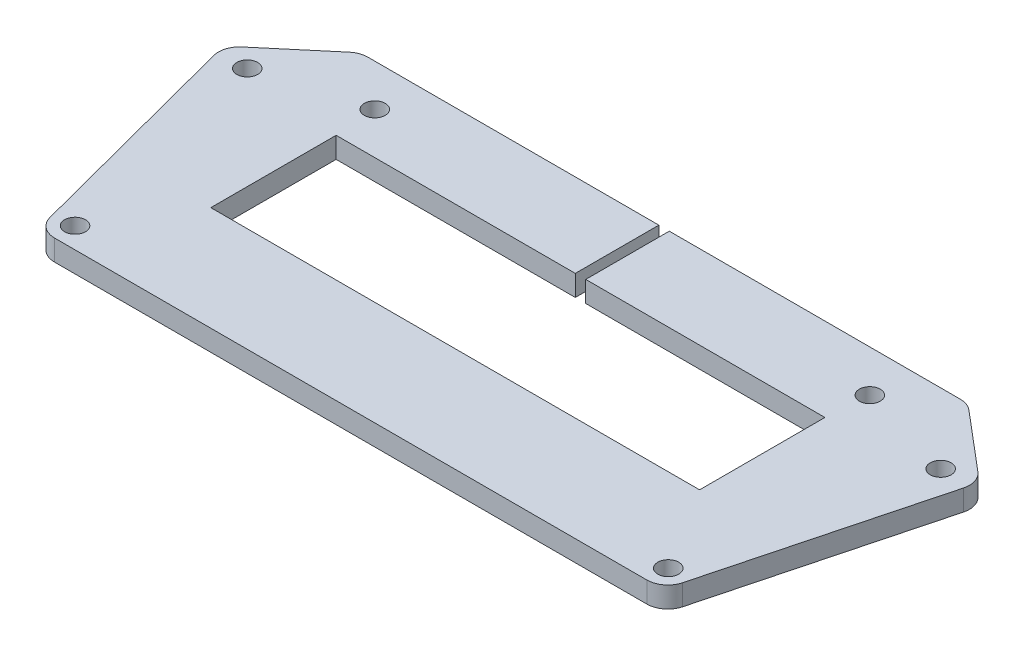
ISO-10303-21;
HEADER;
FILE_DESCRIPTION(('STEP AP214'),'2;1');
FILE_NAME('part.step','',(''),(''),'','','');
FILE_SCHEMA(('AUTOMOTIVE_DESIGN { 1 0 10303 214 1 1 1 1 }'));
ENDSEC;
DATA;
#1=APPLICATION_CONTEXT('core data for automotive mechanical design processes');
#2=APPLICATION_PROTOCOL_DEFINITION('international standard','automotive_design',2000,#1);
#3=PRODUCT_CONTEXT('',#1,'mechanical');
#4=PRODUCT('Part','Part','',(#3));
#5=PRODUCT_RELATED_PRODUCT_CATEGORY('part','',(#4));
#6=PRODUCT_DEFINITION_FORMATION('','',#4);
#7=PRODUCT_DEFINITION_CONTEXT('part definition',#1,'design');
#8=PRODUCT_DEFINITION('design','',#6,#7);
#9=PRODUCT_DEFINITION_SHAPE('','',#8);
#10=(LENGTH_UNIT() NAMED_UNIT(*) SI_UNIT(.MILLI.,.METRE.));
#11=(NAMED_UNIT(*) PLANE_ANGLE_UNIT() SI_UNIT($,.RADIAN.));
#12=(NAMED_UNIT(*) SI_UNIT($,.STERADIAN.) SOLID_ANGLE_UNIT());
#13=UNCERTAINTY_MEASURE_WITH_UNIT(LENGTH_MEASURE(1.E-05),#10,'distance_accuracy_value','');
#14=(GEOMETRIC_REPRESENTATION_CONTEXT(3) GLOBAL_UNCERTAINTY_ASSIGNED_CONTEXT((#13)) GLOBAL_UNIT_ASSIGNED_CONTEXT((#10,
#11,#12)) REPRESENTATION_CONTEXT('',''));
#15=CARTESIAN_POINT('',(0.,0.,0.));
#16=DIRECTION('',(0.,0.,1.));
#17=DIRECTION('',(1.,0.,0.));
#18=AXIS2_PLACEMENT_3D('',#15,#16,#17);
#19=CARTESIAN_POINT('',(-11.7,-1.,-3.));
#20=DIRECTION('',(1.,0.,0.));
#21=DIRECTION('',(0.,0.,-1.));
#22=AXIS2_PLACEMENT_3D('',#19,#20,#21);
#23=PLANE('',#22);
#24=DIRECTION('',(0.,0.,-1.));
#25=VECTOR('',#24,1.);
#26=CARTESIAN_POINT('',(-11.7,0.,-3.));
#27=LINE('',#26,#25);
#28=CARTESIAN_POINT('',(-11.7,0.,3.));
#29=VERTEX_POINT('',#28);
#30=CARTESIAN_POINT('',(-11.7,0.,-3.));
#31=VERTEX_POINT('',#30);
#32=EDGE_CURVE('E210',#29,#31,#27,.T.);
#33=ORIENTED_EDGE('',*,*,#32,.F.);
#34=DIRECTION('',(0.,1.,0.));
#35=VECTOR('',#34,1.);
#36=CARTESIAN_POINT('',(-11.7,-1.,3.));
#37=LINE('',#36,#35);
#38=CARTESIAN_POINT('',(-11.7,-1.,3.));
#39=VERTEX_POINT('',#38);
#40=EDGE_CURVE('E12',#39,#29,#37,.T.);
#41=ORIENTED_EDGE('',*,*,#40,.F.);
#42=DIRECTION('',(0.,0.,-1.));
#43=VECTOR('',#42,1.);
#44=CARTESIAN_POINT('',(-11.7,-1.,-3.));
#45=LINE('',#44,#43);
#46=CARTESIAN_POINT('',(-11.7,-1.,-3.));
#47=VERTEX_POINT('',#46);
#48=EDGE_CURVE('E267',#39,#47,#45,.T.);
#49=ORIENTED_EDGE('',*,*,#48,.T.);
#50=DIRECTION('',(0.,1.,0.));
#51=VECTOR('',#50,1.);
#52=CARTESIAN_POINT('',(-11.7,-1.,-3.));
#53=LINE('',#52,#51);
#54=EDGE_CURVE('E44',#47,#31,#53,.T.);
#55=ORIENTED_EDGE('',*,*,#54,.T.);
#56=EDGE_LOOP('',(#33,#41,#49,#55));
#57=FACE_BOUND('',#56,.T.);
#58=ADVANCED_FACE('F41',(#57),#23,.T.);
#59=CARTESIAN_POINT('',(-11.7,-1.,3.));
#60=DIRECTION('',(0.,0.,-1.));
#61=DIRECTION('',(-1.,0.,0.));
#62=AXIS2_PLACEMENT_3D('',#59,#60,#61);
#63=PLANE('',#62);
#64=DIRECTION('',(-1.,0.,0.));
#65=VECTOR('',#64,1.);
#66=CARTESIAN_POINT('',(-11.7,0.,3.));
#67=LINE('',#66,#65);
#68=CARTESIAN_POINT('',(11.7,0.,3.));
#69=VERTEX_POINT('',#68);
#70=EDGE_CURVE('E265',#69,#29,#67,.T.);
#71=ORIENTED_EDGE('',*,*,#70,.F.);
#72=DIRECTION('',(0.,1.,0.));
#73=VECTOR('',#72,1.);
#74=CARTESIAN_POINT('',(11.7,-1.,3.));
#75=LINE('',#74,#73);
#76=CARTESIAN_POINT('',(11.7,-1.,3.));
#77=VERTEX_POINT('',#76);
#78=EDGE_CURVE('E50',#77,#69,#75,.T.);
#79=ORIENTED_EDGE('',*,*,#78,.F.);
#80=DIRECTION('',(-1.,0.,0.));
#81=VECTOR('',#80,1.);
#82=CARTESIAN_POINT('',(-11.7,-1.,3.));
#83=LINE('',#82,#81);
#84=EDGE_CURVE('E200',#77,#39,#83,.T.);
#85=ORIENTED_EDGE('',*,*,#84,.T.);
#86=ORIENTED_EDGE('',*,*,#40,.T.);
#87=EDGE_LOOP('',(#71,#79,#85,#86));
#88=FACE_BOUND('',#87,.T.);
#89=ADVANCED_FACE('F303',(#88),#63,.T.);
#90=CARTESIAN_POINT('',(11.7,-1.,-3.));
#91=DIRECTION('',(-1.,0.,0.));
#92=DIRECTION('',(0.,0.,1.));
#93=AXIS2_PLACEMENT_3D('',#90,#91,#92);
#94=PLANE('',#93);
#95=DIRECTION('',(0.,0.,1.));
#96=VECTOR('',#95,1.);
#97=CARTESIAN_POINT('',(11.7,0.,-3.));
#98=LINE('',#97,#96);
#99=CARTESIAN_POINT('',(11.7,0.,-3.));
#100=VERTEX_POINT('',#99);
#101=EDGE_CURVE('E187',#100,#69,#98,.T.);
#102=ORIENTED_EDGE('',*,*,#101,.F.);
#103=DIRECTION('',(0.,1.,0.));
#104=VECTOR('',#103,1.);
#105=CARTESIAN_POINT('',(11.7,-1.,-3.));
#106=LINE('',#105,#104);
#107=CARTESIAN_POINT('',(11.7,-1.,-3.));
#108=VERTEX_POINT('',#107);
#109=EDGE_CURVE('E182',#108,#100,#106,.T.);
#110=ORIENTED_EDGE('',*,*,#109,.F.);
#111=DIRECTION('',(0.,0.,1.));
#112=VECTOR('',#111,1.);
#113=CARTESIAN_POINT('',(11.7,-1.,-3.));
#114=LINE('',#113,#112);
#115=EDGE_CURVE('E185',#108,#77,#114,.T.);
#116=ORIENTED_EDGE('',*,*,#115,.T.);
#117=ORIENTED_EDGE('',*,*,#78,.T.);
#118=EDGE_LOOP('',(#102,#110,#116,#117));
#119=FACE_BOUND('',#118,.T.);
#120=ADVANCED_FACE('F184',(#119),#94,.T.);
#121=CARTESIAN_POINT('',(0.25,-1.,-3.));
#122=DIRECTION('',(0.,0.,1.));
#123=DIRECTION('',(1.,0.,0.));
#124=AXIS2_PLACEMENT_3D('',#121,#122,#123);
#125=PLANE('',#124);
#126=DIRECTION('',(1.,0.,0.));
#127=VECTOR('',#126,1.);
#128=CARTESIAN_POINT('',(0.25,0.,-3.));
#129=LINE('',#128,#127);
#130=CARTESIAN_POINT('',(0.25,0.,-3.));
#131=VERTEX_POINT('',#130);
#132=EDGE_CURVE('E262',#131,#100,#129,.T.);
#133=ORIENTED_EDGE('',*,*,#132,.F.);
#134=DIRECTION('',(0.,1.,0.));
#135=VECTOR('',#134,1.);
#136=CARTESIAN_POINT('',(0.25,-1.,-3.));
#137=LINE('',#136,#135);
#138=CARTESIAN_POINT('',(0.25,-1.,-3.));
#139=VERTEX_POINT('',#138);
#140=EDGE_CURVE('E192',#139,#131,#137,.T.);
#141=ORIENTED_EDGE('',*,*,#140,.F.);
#142=DIRECTION('',(1.,0.,0.));
#143=VECTOR('',#142,1.);
#144=CARTESIAN_POINT('',(0.25,-1.,-3.));
#145=LINE('',#144,#143);
#146=EDGE_CURVE('E198',#139,#108,#145,.T.);
#147=ORIENTED_EDGE('',*,*,#146,.T.);
#148=ORIENTED_EDGE('',*,*,#109,.T.);
#149=EDGE_LOOP('',(#133,#141,#147,#148));
#150=FACE_BOUND('',#149,.T.);
#151=ADVANCED_FACE('F202',(#150),#125,.T.);
#152=CARTESIAN_POINT('',(0.249999999999999,-1.,-7.));
#153=DIRECTION('',(-1.,0.,0.));
#154=DIRECTION('',(0.,0.,1.));
#155=AXIS2_PLACEMENT_3D('',#152,#153,#154);
#156=PLANE('',#155);
#157=DIRECTION('',(0.,0.,1.));
#158=VECTOR('',#157,1.);
#159=CARTESIAN_POINT('',(0.249999999999999,0.,-7.));
#160=LINE('',#159,#158);
#161=CARTESIAN_POINT('',(0.249999999999999,0.,-7.));
#162=VERTEX_POINT('',#161);
#163=EDGE_CURVE('E259',#162,#131,#160,.T.);
#164=ORIENTED_EDGE('',*,*,#163,.F.);
#165=DIRECTION('',(0.,1.,0.));
#166=VECTOR('',#165,1.);
#167=CARTESIAN_POINT('',(0.249999999999999,-1.,-7.));
#168=LINE('',#167,#166);
#169=CARTESIAN_POINT('',(0.249999999999999,-1.,-7.));
#170=VERTEX_POINT('',#169);
#171=EDGE_CURVE('E271',#170,#162,#168,.T.);
#172=ORIENTED_EDGE('',*,*,#171,.F.);
#173=DIRECTION('',(0.,0.,1.));
#174=VECTOR('',#173,1.);
#175=CARTESIAN_POINT('',(0.249999999999999,-1.,-7.));
#176=LINE('',#175,#174);
#177=EDGE_CURVE('E203',#170,#139,#176,.T.);
#178=ORIENTED_EDGE('',*,*,#177,.T.);
#179=ORIENTED_EDGE('',*,*,#140,.T.);
#180=EDGE_LOOP('',(#164,#172,#178,#179));
#181=FACE_BOUND('',#180,.T.);
#182=ADVANCED_FACE('F316',(#181),#156,.T.);
#183=CARTESIAN_POINT('',(0.249999999999999,-1.,-7.));
#184=DIRECTION('',(0.,0.,-1.));
#185=DIRECTION('',(-1.,0.,0.));
#186=AXIS2_PLACEMENT_3D('',#183,#184,#185);
#187=PLANE('',#186);
#188=DIRECTION('',(-1.,0.,0.));
#189=VECTOR('',#188,1.);
#190=CARTESIAN_POINT('',(0.249999999999999,0.,-7.));
#191=LINE('',#190,#189);
#192=CARTESIAN_POINT('',(14.1840503450521,0.,-7.));
#193=VERTEX_POINT('',#192);
#194=EDGE_CURVE('E256',#193,#162,#191,.T.);
#195=ORIENTED_EDGE('',*,*,#194,.F.);
#196=DIRECTION('',(0.,1.,0.));
#197=VECTOR('',#196,1.);
#198=CARTESIAN_POINT('',(14.1840503450521,-1.,-7.));
#199=LINE('',#198,#197);
#200=CARTESIAN_POINT('',(14.1840503450521,-1.,-7.));
#201=VERTEX_POINT('',#200);
#202=EDGE_CURVE('E273',#201,#193,#199,.T.);
#203=ORIENTED_EDGE('',*,*,#202,.F.);
#204=DIRECTION('',(-1.,0.,0.));
#205=VECTOR('',#204,1.);
#206=CARTESIAN_POINT('',(0.249999999999999,-1.,-7.));
#207=LINE('',#206,#205);
#208=EDGE_CURVE('E205',#201,#170,#207,.T.);
#209=ORIENTED_EDGE('',*,*,#208,.T.);
#210=ORIENTED_EDGE('',*,*,#171,.T.);
#211=EDGE_LOOP('',(#195,#203,#209,#210));
#212=FACE_BOUND('',#211,.T.);
#213=ADVANCED_FACE('F319',(#212),#187,.T.);
#214=CARTESIAN_POINT('',(14.1840503450521,-1.,-6.));
#215=DIRECTION('',(0.,1.,0.));
#216=DIRECTION('',(0.,0.,1.));
#217=AXIS2_PLACEMENT_3D('',#214,#215,#216);
#218=CYLINDRICAL_SURFACE('',#217,0.999999999999998);
#219=CARTESIAN_POINT('',(14.1840503450521,0.,-6.));
#220=DIRECTION('',(0.,1.,0.));
#221=DIRECTION('',(0.,0.,-1.));
#222=AXIS2_PLACEMENT_3D('',#219,#220,#221);
#223=CIRCLE('',#222,0.999999999999998);
#224=CARTESIAN_POINT('',(14.8295102174988,0.,-6.76379418239535));
#225=VERTEX_POINT('',#224);
#226=EDGE_CURVE('E253',#225,#193,#223,.T.);
#227=ORIENTED_EDGE('',*,*,#226,.F.);
#228=DIRECTION('',(0.,1.,0.));
#229=VECTOR('',#228,1.);
#230=CARTESIAN_POINT('',(14.8295102174988,-1.,-6.76379418239535));
#231=LINE('',#230,#229);
#232=CARTESIAN_POINT('',(14.8295102174988,-1.,-6.76379418239535));
#233=VERTEX_POINT('',#232);
#234=EDGE_CURVE('E275',#233,#225,#231,.T.);
#235=ORIENTED_EDGE('',*,*,#234,.F.);
#236=CARTESIAN_POINT('',(14.1840503450521,-1.,-6.));
#237=DIRECTION('',(0.,1.,0.));
#238=DIRECTION('',(0.,0.,-1.));
#239=AXIS2_PLACEMENT_3D('',#236,#237,#238);
#240=CIRCLE('',#239,0.999999999999998);
#241=EDGE_CURVE('E489',#233,#201,#240,.T.);
#242=ORIENTED_EDGE('',*,*,#241,.T.);
#243=ORIENTED_EDGE('',*,*,#202,.T.);
#244=EDGE_LOOP('',(#227,#235,#242,#243));
#245=FACE_BOUND('',#244,.T.);
#246=ADVANCED_FACE('F323',(#245),#218,.T.);
#247=CARTESIAN_POINT('',(17.6180059015459,-1.,-4.40731895644008));
#248=DIRECTION('',(0.645459872446779,0.,-0.763794182395355));
#249=DIRECTION('',(-0.763794182395355,0.,-0.645459872446779));
#250=AXIS2_PLACEMENT_3D('',#247,#248,#249);
#251=PLANE('',#250);
#252=DIRECTION('',(-0.763794182395355,0.,-0.645459872446779));
#253=VECTOR('',#252,1.);
#254=CARTESIAN_POINT('',(17.6180059015459,0.,-4.40731895644008));
#255=LINE('',#254,#253);
#256=CARTESIAN_POINT('',(17.6180059015459,0.,-4.40731895644008));
#257=VERTEX_POINT('',#256);
#258=EDGE_CURVE('E250',#257,#225,#255,.T.);
#259=ORIENTED_EDGE('',*,*,#258,.F.);
#260=DIRECTION('',(0.,1.,0.));
#261=VECTOR('',#260,1.);
#262=CARTESIAN_POINT('',(17.6180059015459,-1.,-4.40731895644008));
#263=LINE('',#262,#261);
#264=CARTESIAN_POINT('',(17.6180059015459,-1.,-4.40731895644008));
#265=VERTEX_POINT('',#264);
#266=EDGE_CURVE('E277',#265,#257,#263,.T.);
#267=ORIENTED_EDGE('',*,*,#266,.F.);
#268=DIRECTION('',(-0.763794182395355,0.,-0.645459872446779));
#269=VECTOR('',#268,1.);
#270=CARTESIAN_POINT('',(17.6180059015459,-1.,-4.40731895644008));
#271=LINE('',#270,#269);
#272=EDGE_CURVE('E486',#265,#233,#271,.T.);
#273=ORIENTED_EDGE('',*,*,#272,.T.);
#274=ORIENTED_EDGE('',*,*,#234,.T.);
#275=EDGE_LOOP('',(#259,#267,#273,#274));
#276=FACE_BOUND('',#275,.T.);
#277=ADVANCED_FACE('F327',(#276),#251,.T.);
#278=CARTESIAN_POINT('',(16.9725460290991,-1.,-3.64352477404472));
#279=DIRECTION('',(0.,1.,0.));
#280=DIRECTION('',(0.,0.,1.));
#281=AXIS2_PLACEMENT_3D('',#278,#279,#280);
#282=CYLINDRICAL_SURFACE('',#281,1.);
#283=CARTESIAN_POINT('',(16.9725460290991,0.,-3.64352477404472));
#284=DIRECTION('',(0.,1.,0.));
#285=DIRECTION('',(0.,0.,-1.));
#286=AXIS2_PLACEMENT_3D('',#283,#284,#285);
#287=CIRCLE('',#286,1.);
#288=CARTESIAN_POINT('',(17.9397769944786,0.,-3.38962664563262));
#289=VERTEX_POINT('',#288);
#290=EDGE_CURVE('E247',#289,#257,#287,.T.);
#291=ORIENTED_EDGE('',*,*,#290,.F.);
#292=DIRECTION('',(0.,1.,0.));
#293=VECTOR('',#292,1.);
#294=CARTESIAN_POINT('',(17.9397769944786,-1.,-3.38962664563262));
#295=LINE('',#294,#293);
#296=CARTESIAN_POINT('',(17.9397769944786,-1.,-3.38962664563262));
#297=VERTEX_POINT('',#296);
#298=EDGE_CURVE('E279',#297,#289,#295,.T.);
#299=ORIENTED_EDGE('',*,*,#298,.F.);
#300=CARTESIAN_POINT('',(16.9725460290991,-1.,-3.64352477404472));
#301=DIRECTION('',(0.,1.,0.));
#302=DIRECTION('',(0.,0.,-1.));
#303=AXIS2_PLACEMENT_3D('',#300,#301,#302);
#304=CIRCLE('',#303,1.);
#305=EDGE_CURVE('E483',#297,#265,#304,.T.);
#306=ORIENTED_EDGE('',*,*,#305,.T.);
#307=ORIENTED_EDGE('',*,*,#266,.T.);
#308=EDGE_LOOP('',(#291,#299,#306,#307));
#309=FACE_BOUND('',#308,.T.);
#310=ADVANCED_FACE('F331',(#309),#282,.T.);
#311=CARTESIAN_POINT('',(15.1458517412918,-1.,7.2538981284121));
#312=DIRECTION('',(0.967230965379434,0.,0.253898128412102));
#313=DIRECTION('',(0.253898128412102,0.,-0.967230965379434));
#314=AXIS2_PLACEMENT_3D('',#311,#312,#313);
#315=PLANE('',#314);
#316=DIRECTION('',(0.253898128412102,0.,-0.967230965379434));
#317=VECTOR('',#316,1.);
#318=CARTESIAN_POINT('',(15.1458517412918,0.,7.2538981284121));
#319=LINE('',#318,#317);
#320=CARTESIAN_POINT('',(15.1458517412918,0.,7.2538981284121));
#321=VERTEX_POINT('',#320);
#322=EDGE_CURVE('E244',#321,#289,#319,.T.);
#323=ORIENTED_EDGE('',*,*,#322,.F.);
#324=DIRECTION('',(0.,1.,0.));
#325=VECTOR('',#324,1.);
#326=CARTESIAN_POINT('',(15.1458517412918,-1.,7.2538981284121));
#327=LINE('',#326,#325);
#328=CARTESIAN_POINT('',(15.1458517412918,-1.,7.2538981284121));
#329=VERTEX_POINT('',#328);
#330=EDGE_CURVE('E281',#329,#321,#327,.T.);
#331=ORIENTED_EDGE('',*,*,#330,.F.);
#332=DIRECTION('',(0.253898128412102,0.,-0.967230965379434));
#333=VECTOR('',#332,1.);
#334=CARTESIAN_POINT('',(15.1458517412918,-1.,7.2538981284121));
#335=LINE('',#334,#333);
#336=EDGE_CURVE('E480',#329,#297,#335,.T.);
#337=ORIENTED_EDGE('',*,*,#336,.T.);
#338=ORIENTED_EDGE('',*,*,#298,.T.);
#339=EDGE_LOOP('',(#323,#331,#337,#338));
#340=FACE_BOUND('',#339,.T.);
#341=ADVANCED_FACE('F335',(#340),#315,.T.);
#342=CARTESIAN_POINT('',(14.1786207759124,-1.,7.));
#343=DIRECTION('',(0.,1.,0.));
#344=DIRECTION('',(0.,0.,1.));
#345=AXIS2_PLACEMENT_3D('',#342,#343,#344);
#346=CYLINDRICAL_SURFACE('',#345,1.);
#347=CARTESIAN_POINT('',(14.1786207759124,0.,7.));
#348=DIRECTION('',(0.,1.,0.));
#349=DIRECTION('',(0.,0.,1.));
#350=AXIS2_PLACEMENT_3D('',#347,#348,#349);
#351=CIRCLE('',#350,1.);
#352=CARTESIAN_POINT('',(14.1786207759124,0.,8.));
#353=VERTEX_POINT('',#352);
#354=EDGE_CURVE('E241',#353,#321,#351,.T.);
#355=ORIENTED_EDGE('',*,*,#354,.F.);
#356=DIRECTION('',(0.,1.,0.));
#357=VECTOR('',#356,1.);
#358=CARTESIAN_POINT('',(14.1786207759124,-1.,8.));
#359=LINE('',#358,#357);
#360=CARTESIAN_POINT('',(14.1786207759124,-1.,8.));
#361=VERTEX_POINT('',#360);
#362=EDGE_CURVE('E283',#361,#353,#359,.T.);
#363=ORIENTED_EDGE('',*,*,#362,.F.);
#364=CARTESIAN_POINT('',(14.1786207759124,-1.,7.));
#365=DIRECTION('',(0.,1.,0.));
#366=DIRECTION('',(0.,0.,1.));
#367=AXIS2_PLACEMENT_3D('',#364,#365,#366);
#368=CIRCLE('',#367,1.);
#369=EDGE_CURVE('E477',#361,#329,#368,.T.);
#370=ORIENTED_EDGE('',*,*,#369,.T.);
#371=ORIENTED_EDGE('',*,*,#330,.T.);
#372=EDGE_LOOP('',(#355,#363,#370,#371));
#373=FACE_BOUND('',#372,.T.);
#374=ADVANCED_FACE('F339',(#373),#346,.T.);
#375=CARTESIAN_POINT('',(-14.1786207759124,-1.,8.));
#376=DIRECTION('',(0.,0.,1.));
#377=DIRECTION('',(1.,0.,0.));
#378=AXIS2_PLACEMENT_3D('',#375,#376,#377);
#379=PLANE('',#378);
#380=DIRECTION('',(1.,0.,0.));
#381=VECTOR('',#380,1.);
#382=CARTESIAN_POINT('',(-14.1786207759124,0.,8.));
#383=LINE('',#382,#381);
#384=CARTESIAN_POINT('',(-14.1786207759124,0.,8.));
#385=VERTEX_POINT('',#384);
#386=EDGE_CURVE('E238',#385,#353,#383,.T.);
#387=ORIENTED_EDGE('',*,*,#386,.F.);
#388=DIRECTION('',(0.,1.,0.));
#389=VECTOR('',#388,1.);
#390=CARTESIAN_POINT('',(-14.1786207759124,-1.,8.));
#391=LINE('',#390,#389);
#392=CARTESIAN_POINT('',(-14.1786207759124,-1.,8.));
#393=VERTEX_POINT('',#392);
#394=EDGE_CURVE('E285',#393,#385,#391,.T.);
#395=ORIENTED_EDGE('',*,*,#394,.F.);
#396=DIRECTION('',(1.,0.,0.));
#397=VECTOR('',#396,1.);
#398=CARTESIAN_POINT('',(-14.1786207759124,-1.,8.));
#399=LINE('',#398,#397);
#400=EDGE_CURVE('E474',#393,#361,#399,.T.);
#401=ORIENTED_EDGE('',*,*,#400,.T.);
#402=ORIENTED_EDGE('',*,*,#362,.T.);
#403=EDGE_LOOP('',(#387,#395,#401,#402));
#404=FACE_BOUND('',#403,.T.);
#405=ADVANCED_FACE('F343',(#404),#379,.T.);
#406=CARTESIAN_POINT('',(-14.1786207759124,-1.,7.));
#407=DIRECTION('',(0.,1.,0.));
#408=DIRECTION('',(0.,0.,1.));
#409=AXIS2_PLACEMENT_3D('',#406,#407,#408);
#410=CYLINDRICAL_SURFACE('',#409,1.);
#411=CARTESIAN_POINT('',(-14.1786207759124,0.,7.));
#412=DIRECTION('',(0.,1.,0.));
#413=DIRECTION('',(0.,0.,-1.));
#414=AXIS2_PLACEMENT_3D('',#411,#412,#413);
#415=CIRCLE('',#414,1.);
#416=CARTESIAN_POINT('',(-15.1458517412918,0.,7.2538981284121));
#417=VERTEX_POINT('',#416);
#418=EDGE_CURVE('E235',#417,#385,#415,.T.);
#419=ORIENTED_EDGE('',*,*,#418,.F.);
#420=DIRECTION('',(0.,1.,0.));
#421=VECTOR('',#420,1.);
#422=CARTESIAN_POINT('',(-15.1458517412918,-1.,7.2538981284121));
#423=LINE('',#422,#421);
#424=CARTESIAN_POINT('',(-15.1458517412918,-1.,7.2538981284121));
#425=VERTEX_POINT('',#424);
#426=EDGE_CURVE('E287',#425,#417,#423,.T.);
#427=ORIENTED_EDGE('',*,*,#426,.F.);
#428=CARTESIAN_POINT('',(-14.1786207759124,-1.,7.));
#429=DIRECTION('',(0.,1.,0.));
#430=DIRECTION('',(0.,0.,-1.));
#431=AXIS2_PLACEMENT_3D('',#428,#429,#430);
#432=CIRCLE('',#431,1.);
#433=EDGE_CURVE('E471',#425,#393,#432,.T.);
#434=ORIENTED_EDGE('',*,*,#433,.T.);
#435=ORIENTED_EDGE('',*,*,#394,.T.);
#436=EDGE_LOOP('',(#419,#427,#434,#435));
#437=FACE_BOUND('',#436,.T.);
#438=ADVANCED_FACE('F347',(#437),#410,.T.);
#439=CARTESIAN_POINT('',(-15.1458517412918,-1.,7.2538981284121));
#440=DIRECTION('',(-0.967230965379434,0.,0.253898128412102));
#441=DIRECTION('',(0.253898128412102,0.,0.967230965379434));
#442=AXIS2_PLACEMENT_3D('',#439,#440,#441);
#443=PLANE('',#442);
#444=DIRECTION('',(0.253898128412102,0.,0.967230965379434));
#445=VECTOR('',#444,1.);
#446=CARTESIAN_POINT('',(-15.1458517412918,0.,7.2538981284121));
#447=LINE('',#446,#445);
#448=CARTESIAN_POINT('',(-17.9397769944786,0.,-3.38962664563262));
#449=VERTEX_POINT('',#448);
#450=EDGE_CURVE('E232',#449,#417,#447,.T.);
#451=ORIENTED_EDGE('',*,*,#450,.F.);
#452=DIRECTION('',(0.,1.,0.));
#453=VECTOR('',#452,1.);
#454=CARTESIAN_POINT('',(-17.9397769944786,-1.,-3.38962664563262));
#455=LINE('',#454,#453);
#456=CARTESIAN_POINT('',(-17.9397769944786,-1.,-3.38962664563262));
#457=VERTEX_POINT('',#456);
#458=EDGE_CURVE('E289',#457,#449,#455,.T.);
#459=ORIENTED_EDGE('',*,*,#458,.F.);
#460=DIRECTION('',(0.253898128412102,0.,0.967230965379434));
#461=VECTOR('',#460,1.);
#462=CARTESIAN_POINT('',(-15.1458517412918,-1.,7.2538981284121));
#463=LINE('',#462,#461);
#464=EDGE_CURVE('E468',#457,#425,#463,.T.);
#465=ORIENTED_EDGE('',*,*,#464,.T.);
#466=ORIENTED_EDGE('',*,*,#426,.T.);
#467=EDGE_LOOP('',(#451,#459,#465,#466));
#468=FACE_BOUND('',#467,.T.);
#469=ADVANCED_FACE('F351',(#468),#443,.T.);
#470=CARTESIAN_POINT('',(-16.9725460290991,-1.,-3.64352477404472));
#471=DIRECTION('',(0.,1.,0.));
#472=DIRECTION('',(0.,0.,1.));
#473=AXIS2_PLACEMENT_3D('',#470,#471,#472);
#474=CYLINDRICAL_SURFACE('',#473,1.);
#475=CARTESIAN_POINT('',(-16.9725460290991,0.,-3.64352477404472));
#476=DIRECTION('',(0.,1.,0.));
#477=DIRECTION('',(0.,0.,-1.));
#478=AXIS2_PLACEMENT_3D('',#475,#476,#477);
#479=CIRCLE('',#478,1.);
#480=CARTESIAN_POINT('',(-17.6180059015459,0.,-4.40731895644007));
#481=VERTEX_POINT('',#480);
#482=EDGE_CURVE('E229',#481,#449,#479,.T.);
#483=ORIENTED_EDGE('',*,*,#482,.F.);
#484=DIRECTION('',(0.,1.,0.));
#485=VECTOR('',#484,1.);
#486=CARTESIAN_POINT('',(-17.6180059015459,-1.,-4.40731895644007));
#487=LINE('',#486,#485);
#488=CARTESIAN_POINT('',(-17.6180059015459,-1.,-4.40731895644007));
#489=VERTEX_POINT('',#488);
#490=EDGE_CURVE('E291',#489,#481,#487,.T.);
#491=ORIENTED_EDGE('',*,*,#490,.F.);
#492=CARTESIAN_POINT('',(-16.9725460290991,-1.,-3.64352477404472));
#493=DIRECTION('',(0.,1.,0.));
#494=DIRECTION('',(0.,0.,-1.));
#495=AXIS2_PLACEMENT_3D('',#492,#493,#494);
#496=CIRCLE('',#495,1.);
#497=EDGE_CURVE('E465',#489,#457,#496,.T.);
#498=ORIENTED_EDGE('',*,*,#497,.T.);
#499=ORIENTED_EDGE('',*,*,#458,.T.);
#500=EDGE_LOOP('',(#483,#491,#498,#499));
#501=FACE_BOUND('',#500,.T.);
#502=ADVANCED_FACE('F355',(#501),#474,.T.);
#503=CARTESIAN_POINT('',(-17.6180059015459,-1.,-4.40731895644007));
#504=DIRECTION('',(-0.645459872446779,0.,-0.763794182395354));
#505=DIRECTION('',(-0.763794182395354,0.,0.645459872446779));
#506=AXIS2_PLACEMENT_3D('',#503,#504,#505);
#507=PLANE('',#506);
#508=DIRECTION('',(-0.763794182395354,0.,0.64545987244678));
#509=VECTOR('',#508,1.);
#510=CARTESIAN_POINT('',(-17.6180059015459,0.,-4.40731895644007));
#511=LINE('',#510,#509);
#512=CARTESIAN_POINT('',(-14.8295102174988,0.,-6.76379418239535));
#513=VERTEX_POINT('',#512);
#514=EDGE_CURVE('E226',#513,#481,#511,.T.);
#515=ORIENTED_EDGE('',*,*,#514,.F.);
#516=DIRECTION('',(0.,1.,0.));
#517=VECTOR('',#516,1.);
#518=CARTESIAN_POINT('',(-14.8295102174988,-1.,-6.76379418239535));
#519=LINE('',#518,#517);
#520=CARTESIAN_POINT('',(-14.8295102174988,-1.,-6.76379418239535));
#521=VERTEX_POINT('',#520);
#522=EDGE_CURVE('E293',#521,#513,#519,.T.);
#523=ORIENTED_EDGE('',*,*,#522,.F.);
#524=DIRECTION('',(-0.763794182395354,0.,0.64545987244678));
#525=VECTOR('',#524,1.);
#526=CARTESIAN_POINT('',(-17.6180059015459,-1.,-4.40731895644007));
#527=LINE('',#526,#525);
#528=EDGE_CURVE('E462',#521,#489,#527,.T.);
#529=ORIENTED_EDGE('',*,*,#528,.T.);
#530=ORIENTED_EDGE('',*,*,#490,.T.);
#531=EDGE_LOOP('',(#515,#523,#529,#530));
#532=FACE_BOUND('',#531,.T.);
#533=ADVANCED_FACE('F359',(#532),#507,.T.);
#534=CARTESIAN_POINT('',(-14.1840503450521,-1.,-6.));
#535=DIRECTION('',(0.,1.,0.));
#536=DIRECTION('',(0.,0.,1.));
#537=AXIS2_PLACEMENT_3D('',#534,#535,#536);
#538=CYLINDRICAL_SURFACE('',#537,1.);
#539=CARTESIAN_POINT('',(-14.1840503450521,0.,-6.));
#540=DIRECTION('',(0.,1.,0.));
#541=DIRECTION('',(0.,0.,-1.));
#542=AXIS2_PLACEMENT_3D('',#539,#540,#541);
#543=CIRCLE('',#542,1.);
#544=CARTESIAN_POINT('',(-14.1840503450521,0.,-7.));
#545=VERTEX_POINT('',#544);
#546=EDGE_CURVE('E223',#545,#513,#543,.T.);
#547=ORIENTED_EDGE('',*,*,#546,.F.);
#548=DIRECTION('',(0.,1.,0.));
#549=VECTOR('',#548,1.);
#550=CARTESIAN_POINT('',(-14.1840503450521,-1.,-7.));
#551=LINE('',#550,#549);
#552=CARTESIAN_POINT('',(-14.1840503450521,-1.,-7.));
#553=VERTEX_POINT('',#552);
#554=EDGE_CURVE('E295',#553,#545,#551,.T.);
#555=ORIENTED_EDGE('',*,*,#554,.F.);
#556=CARTESIAN_POINT('',(-14.1840503450521,-1.,-6.));
#557=DIRECTION('',(0.,1.,0.));
#558=DIRECTION('',(0.,0.,-1.));
#559=AXIS2_PLACEMENT_3D('',#556,#557,#558);
#560=CIRCLE('',#559,1.);
#561=EDGE_CURVE('E459',#553,#521,#560,.T.);
#562=ORIENTED_EDGE('',*,*,#561,.T.);
#563=ORIENTED_EDGE('',*,*,#522,.T.);
#564=EDGE_LOOP('',(#547,#555,#562,#563));
#565=FACE_BOUND('',#564,.T.);
#566=ADVANCED_FACE('F363',(#565),#538,.T.);
#567=CARTESIAN_POINT('',(-14.1840503450521,-1.,-7.));
#568=DIRECTION('',(0.,0.,-1.));
#569=DIRECTION('',(-1.,0.,0.));
#570=AXIS2_PLACEMENT_3D('',#567,#568,#569);
#571=PLANE('',#570);
#572=DIRECTION('',(-1.,0.,0.));
#573=VECTOR('',#572,1.);
#574=CARTESIAN_POINT('',(-14.1840503450521,0.,-7.));
#575=LINE('',#574,#573);
#576=CARTESIAN_POINT('',(-0.250000000000001,0.,-7.));
#577=VERTEX_POINT('',#576);
#578=EDGE_CURVE('E220',#577,#545,#575,.T.);
#579=ORIENTED_EDGE('',*,*,#578,.F.);
#580=DIRECTION('',(0.,1.,0.));
#581=VECTOR('',#580,1.);
#582=CARTESIAN_POINT('',(-0.250000000000001,-1.,-7.));
#583=LINE('',#582,#581);
#584=CARTESIAN_POINT('',(-0.250000000000001,-1.,-7.));
#585=VERTEX_POINT('',#584);
#586=EDGE_CURVE('E297',#585,#577,#583,.T.);
#587=ORIENTED_EDGE('',*,*,#586,.F.);
#588=DIRECTION('',(-1.,0.,0.));
#589=VECTOR('',#588,1.);
#590=CARTESIAN_POINT('',(-14.1840503450521,-1.,-7.));
#591=LINE('',#590,#589);
#592=EDGE_CURVE('E456',#585,#553,#591,.T.);
#593=ORIENTED_EDGE('',*,*,#592,.T.);
#594=ORIENTED_EDGE('',*,*,#554,.T.);
#595=EDGE_LOOP('',(#579,#587,#593,#594));
#596=FACE_BOUND('',#595,.T.);
#597=ADVANCED_FACE('F367',(#596),#571,.T.);
#598=CARTESIAN_POINT('',(-0.250000000000001,-1.,-7.));
#599=DIRECTION('',(1.,0.,0.));
#600=DIRECTION('',(0.,0.,-1.));
#601=AXIS2_PLACEMENT_3D('',#598,#599,#600);
#602=PLANE('',#601);
#603=DIRECTION('',(0.,0.,-1.));
#604=VECTOR('',#603,1.);
#605=CARTESIAN_POINT('',(-0.250000000000001,0.,-7.));
#606=LINE('',#605,#604);
#607=CARTESIAN_POINT('',(-0.25,0.,-3.));
#608=VERTEX_POINT('',#607);
#609=EDGE_CURVE('E217',#608,#577,#606,.T.);
#610=ORIENTED_EDGE('',*,*,#609,.F.);
#611=DIRECTION('',(0.,1.,0.));
#612=VECTOR('',#611,1.);
#613=CARTESIAN_POINT('',(-0.25,-1.,-3.));
#614=LINE('',#613,#612);
#615=CARTESIAN_POINT('',(-0.25,-1.,-3.));
#616=VERTEX_POINT('',#615);
#617=EDGE_CURVE('E298',#616,#608,#614,.T.);
#618=ORIENTED_EDGE('',*,*,#617,.F.);
#619=DIRECTION('',(0.,0.,-1.));
#620=VECTOR('',#619,1.);
#621=CARTESIAN_POINT('',(-0.250000000000001,-1.,-7.));
#622=LINE('',#621,#620);
#623=EDGE_CURVE('E453',#616,#585,#622,.T.);
#624=ORIENTED_EDGE('',*,*,#623,.T.);
#625=ORIENTED_EDGE('',*,*,#586,.T.);
#626=EDGE_LOOP('',(#610,#618,#624,#625));
#627=FACE_BOUND('',#626,.T.);
#628=ADVANCED_FACE('F371',(#627),#602,.T.);
#629=CARTESIAN_POINT('',(-11.7,-1.,-3.));
#630=DIRECTION('',(0.,0.,1.));
#631=DIRECTION('',(1.,0.,0.));
#632=AXIS2_PLACEMENT_3D('',#629,#630,#631);
#633=PLANE('',#632);
#634=DIRECTION('',(1.,0.,0.));
#635=VECTOR('',#634,1.);
#636=CARTESIAN_POINT('',(-11.7,0.,-3.));
#637=LINE('',#636,#635);
#638=EDGE_CURVE('E213',#31,#608,#637,.T.);
#639=ORIENTED_EDGE('',*,*,#638,.F.);
#640=ORIENTED_EDGE('',*,*,#54,.F.);
#641=DIRECTION('',(1.,0.,0.));
#642=VECTOR('',#641,1.);
#643=CARTESIAN_POINT('',(-11.7,-1.,-3.));
#644=LINE('',#643,#642);
#645=EDGE_CURVE('E451',#47,#616,#644,.T.);
#646=ORIENTED_EDGE('',*,*,#645,.T.);
#647=ORIENTED_EDGE('',*,*,#617,.T.);
#648=EDGE_LOOP('',(#639,#640,#646,#647));
#649=FACE_BOUND('',#648,.T.);
#650=ADVANCED_FACE('F300',(#649),#633,.T.);
#651=CARTESIAN_POINT('',(14.1840503450521,-1.,-6.));
#652=DIRECTION('',(0.,-1.,0.));
#653=DIRECTION('',(0.,0.,-1.));
#654=AXIS2_PLACEMENT_3D('',#651,#652,#653);
#655=PLANE('',#654);
#656=CARTESIAN_POINT('',(-11.85,-1.,-5.));
#657=DIRECTION('',(0.,1.,0.));
#658=DIRECTION('',(0.,0.,1.));
#659=AXIS2_PLACEMENT_3D('',#656,#657,#658);
#660=CIRCLE('',#659,0.500000000000001);
#661=CARTESIAN_POINT('',(-11.85,-1.,-4.5));
#662=VERTEX_POINT('',#661);
#663=EDGE_CURVE('E414',#662,#662,#660,.T.);
#664=ORIENTED_EDGE('',*,*,#663,.T.);
#665=EDGE_LOOP('',(#664));
#666=FACE_BOUND('',#665,.T.);
#667=CARTESIAN_POINT('',(11.85,-1.,-5.));
#668=DIRECTION('',(0.,1.,0.));
#669=DIRECTION('',(0.,0.,1.));
#670=AXIS2_PLACEMENT_3D('',#667,#668,#669);
#671=CIRCLE('',#670,0.500000000000001);
#672=CARTESIAN_POINT('',(11.85,-1.,-4.5));
#673=VERTEX_POINT('',#672);
#674=EDGE_CURVE('E422',#673,#673,#671,.T.);
#675=ORIENTED_EDGE('',*,*,#674,.T.);
#676=EDGE_LOOP('',(#675));
#677=FACE_BOUND('',#676,.T.);
#678=CARTESIAN_POINT('',(16.6,-1.,-3.64352477404472));
#679=DIRECTION('',(0.,1.,0.));
#680=DIRECTION('',(0.,0.,1.));
#681=AXIS2_PLACEMENT_3D('',#678,#679,#680);
#682=CIRCLE('',#681,0.499999999999999);
#683=CARTESIAN_POINT('',(16.6,-1.,-3.14352477404472));
#684=VERTEX_POINT('',#683);
#685=EDGE_CURVE('E428',#684,#684,#682,.T.);
#686=ORIENTED_EDGE('',*,*,#685,.T.);
#687=EDGE_LOOP('',(#686));
#688=FACE_BOUND('',#687,.T.);
#689=CARTESIAN_POINT('',(-16.6,-1.,-3.64352477404472));
#690=DIRECTION('',(0.,1.,0.));
#691=DIRECTION('',(0.,0.,1.));
#692=AXIS2_PLACEMENT_3D('',#689,#690,#691);
#693=CIRCLE('',#692,0.499999999999999);
#694=CARTESIAN_POINT('',(-16.6,-1.,-3.14352477404472));
#695=VERTEX_POINT('',#694);
#696=EDGE_CURVE('E434',#695,#695,#693,.T.);
#697=ORIENTED_EDGE('',*,*,#696,.T.);
#698=EDGE_LOOP('',(#697));
#699=FACE_BOUND('',#698,.T.);
#700=CARTESIAN_POINT('',(14.2,-1.,7.));
#701=DIRECTION('',(0.,1.,0.));
#702=DIRECTION('',(0.,0.,1.));
#703=AXIS2_PLACEMENT_3D('',#700,#701,#702);
#704=CIRCLE('',#703,0.499999999999999);
#705=CARTESIAN_POINT('',(14.2,-1.,7.5));
#706=VERTEX_POINT('',#705);
#707=EDGE_CURVE('E440',#706,#706,#704,.T.);
#708=ORIENTED_EDGE('',*,*,#707,.T.);
#709=EDGE_LOOP('',(#708));
#710=FACE_BOUND('',#709,.T.);
#711=CARTESIAN_POINT('',(-14.2,-1.,7.));
#712=DIRECTION('',(0.,1.,0.));
#713=DIRECTION('',(0.,0.,1.));
#714=AXIS2_PLACEMENT_3D('',#711,#712,#713);
#715=CIRCLE('',#714,0.500000000000001);
#716=CARTESIAN_POINT('',(-14.2,-1.,7.5));
#717=VERTEX_POINT('',#716);
#718=EDGE_CURVE('E214',#717,#717,#715,.T.);
#719=ORIENTED_EDGE('',*,*,#718,.T.);
#720=EDGE_LOOP('',(#719));
#721=FACE_BOUND('',#720,.T.);
#722=ORIENTED_EDGE('',*,*,#48,.F.);
#723=ORIENTED_EDGE('',*,*,#84,.F.);
#724=ORIENTED_EDGE('',*,*,#115,.F.);
#725=ORIENTED_EDGE('',*,*,#146,.F.);
#726=ORIENTED_EDGE('',*,*,#177,.F.);
#727=ORIENTED_EDGE('',*,*,#208,.F.);
#728=ORIENTED_EDGE('',*,*,#241,.F.);
#729=ORIENTED_EDGE('',*,*,#272,.F.);
#730=ORIENTED_EDGE('',*,*,#305,.F.);
#731=ORIENTED_EDGE('',*,*,#336,.F.);
#732=ORIENTED_EDGE('',*,*,#369,.F.);
#733=ORIENTED_EDGE('',*,*,#400,.F.);
#734=ORIENTED_EDGE('',*,*,#433,.F.);
#735=ORIENTED_EDGE('',*,*,#464,.F.);
#736=ORIENTED_EDGE('',*,*,#497,.F.);
#737=ORIENTED_EDGE('',*,*,#528,.F.);
#738=ORIENTED_EDGE('',*,*,#561,.F.);
#739=ORIENTED_EDGE('',*,*,#592,.F.);
#740=ORIENTED_EDGE('',*,*,#623,.F.);
#741=ORIENTED_EDGE('',*,*,#645,.F.);
#742=EDGE_LOOP('',(#722,#723,#724,#725,#726,#727,#728,#729,#730,#731,#732,#733,#734,#735,#736,
#737,#738,#739,#740,#741));
#743=FACE_BOUND('',#742,.T.);
#744=ADVANCED_FACE('F196',(#666,#677,#688,#699,#710,#721,#743),#655,.T.);
#745=CARTESIAN_POINT('',(14.1840503450521,0.,-6.));
#746=DIRECTION('',(0.,-1.,0.));
#747=DIRECTION('',(0.,0.,-1.));
#748=AXIS2_PLACEMENT_3D('',#745,#746,#747);
#749=PLANE('',#748);
#750=CARTESIAN_POINT('',(-11.85,0.,-5.));
#751=DIRECTION('',(0.,1.,0.));
#752=DIRECTION('',(0.,0.,1.));
#753=AXIS2_PLACEMENT_3D('',#750,#751,#752);
#754=CIRCLE('',#753,0.500000000000001);
#755=CARTESIAN_POINT('',(-11.85,0.,-4.5));
#756=VERTEX_POINT('',#755);
#757=EDGE_CURVE('E417',#756,#756,#754,.T.);
#758=ORIENTED_EDGE('',*,*,#757,.F.);
#759=EDGE_LOOP('',(#758));
#760=FACE_BOUND('',#759,.T.);
#761=CARTESIAN_POINT('',(11.85,0.,-5.));
#762=DIRECTION('',(0.,1.,0.));
#763=DIRECTION('',(0.,0.,1.));
#764=AXIS2_PLACEMENT_3D('',#761,#762,#763);
#765=CIRCLE('',#764,0.500000000000001);
#766=CARTESIAN_POINT('',(11.85,0.,-4.5));
#767=VERTEX_POINT('',#766);
#768=EDGE_CURVE('E419',#767,#767,#765,.T.);
#769=ORIENTED_EDGE('',*,*,#768,.F.);
#770=EDGE_LOOP('',(#769));
#771=FACE_BOUND('',#770,.T.);
#772=CARTESIAN_POINT('',(16.6,0.,-3.64352477404472));
#773=DIRECTION('',(0.,1.,0.));
#774=DIRECTION('',(0.,0.,1.));
#775=AXIS2_PLACEMENT_3D('',#772,#773,#774);
#776=CIRCLE('',#775,0.499999999999999);
#777=CARTESIAN_POINT('',(16.6,0.,-3.14352477404472));
#778=VERTEX_POINT('',#777);
#779=EDGE_CURVE('E425',#778,#778,#776,.T.);
#780=ORIENTED_EDGE('',*,*,#779,.F.);
#781=EDGE_LOOP('',(#780));
#782=FACE_BOUND('',#781,.T.);
#783=CARTESIAN_POINT('',(-16.6,0.,-3.64352477404472));
#784=DIRECTION('',(0.,1.,0.));
#785=DIRECTION('',(0.,0.,1.));
#786=AXIS2_PLACEMENT_3D('',#783,#784,#785);
#787=CIRCLE('',#786,0.499999999999999);
#788=CARTESIAN_POINT('',(-16.6,0.,-3.14352477404472));
#789=VERTEX_POINT('',#788);
#790=EDGE_CURVE('E431',#789,#789,#787,.T.);
#791=ORIENTED_EDGE('',*,*,#790,.F.);
#792=EDGE_LOOP('',(#791));
#793=FACE_BOUND('',#792,.T.);
#794=CARTESIAN_POINT('',(14.2,0.,7.));
#795=DIRECTION('',(0.,1.,0.));
#796=DIRECTION('',(0.,0.,1.));
#797=AXIS2_PLACEMENT_3D('',#794,#795,#796);
#798=CIRCLE('',#797,0.499999999999999);
#799=CARTESIAN_POINT('',(14.2,0.,7.5));
#800=VERTEX_POINT('',#799);
#801=EDGE_CURVE('E437',#800,#800,#798,.T.);
#802=ORIENTED_EDGE('',*,*,#801,.F.);
#803=EDGE_LOOP('',(#802));
#804=FACE_BOUND('',#803,.T.);
#805=CARTESIAN_POINT('',(-14.2,0.,7.));
#806=DIRECTION('',(0.,1.,0.));
#807=DIRECTION('',(0.,0.,1.));
#808=AXIS2_PLACEMENT_3D('',#805,#806,#807);
#809=CIRCLE('',#808,0.500000000000001);
#810=CARTESIAN_POINT('',(-14.2,0.,7.5));
#811=VERTEX_POINT('',#810);
#812=EDGE_CURVE('E443',#811,#811,#809,.T.);
#813=ORIENTED_EDGE('',*,*,#812,.F.);
#814=EDGE_LOOP('',(#813));
#815=FACE_BOUND('',#814,.T.);
#816=ORIENTED_EDGE('',*,*,#32,.T.);
#817=ORIENTED_EDGE('',*,*,#638,.T.);
#818=ORIENTED_EDGE('',*,*,#609,.T.);
#819=ORIENTED_EDGE('',*,*,#578,.T.);
#820=ORIENTED_EDGE('',*,*,#546,.T.);
#821=ORIENTED_EDGE('',*,*,#514,.T.);
#822=ORIENTED_EDGE('',*,*,#482,.T.);
#823=ORIENTED_EDGE('',*,*,#450,.T.);
#824=ORIENTED_EDGE('',*,*,#418,.T.);
#825=ORIENTED_EDGE('',*,*,#386,.T.);
#826=ORIENTED_EDGE('',*,*,#354,.T.);
#827=ORIENTED_EDGE('',*,*,#322,.T.);
#828=ORIENTED_EDGE('',*,*,#290,.T.);
#829=ORIENTED_EDGE('',*,*,#258,.T.);
#830=ORIENTED_EDGE('',*,*,#226,.T.);
#831=ORIENTED_EDGE('',*,*,#194,.T.);
#832=ORIENTED_EDGE('',*,*,#163,.T.);
#833=ORIENTED_EDGE('',*,*,#132,.T.);
#834=ORIENTED_EDGE('',*,*,#101,.T.);
#835=ORIENTED_EDGE('',*,*,#70,.T.);
#836=EDGE_LOOP('',(#816,#817,#818,#819,#820,#821,#822,#823,#824,#825,#826,#827,#828,#829,#830,
#831,#832,#833,#834,#835));
#837=FACE_BOUND('',#836,.T.);
#838=ADVANCED_FACE('F302',(#760,#771,#782,#793,#804,#815,#837),#749,.F.);
#839=CARTESIAN_POINT('',(-14.2,-1.,7.));
#840=DIRECTION('',(0.,1.,0.));
#841=DIRECTION('',(0.,0.,1.));
#842=AXIS2_PLACEMENT_3D('',#839,#840,#841);
#843=CYLINDRICAL_SURFACE('',#842,0.500000000000001);
#844=ORIENTED_EDGE('',*,*,#718,.F.);
#845=EDGE_LOOP('',(#844));
#846=FACE_BOUND('',#845,.T.);
#847=ORIENTED_EDGE('',*,*,#812,.T.);
#848=EDGE_LOOP('',(#847));
#849=FACE_BOUND('',#848,.T.);
#850=ADVANCED_FACE('F383',(#846,#849),#843,.F.);
#851=CARTESIAN_POINT('',(14.2,-1.,7.));
#852=DIRECTION('',(0.,1.,0.));
#853=DIRECTION('',(0.,0.,1.));
#854=AXIS2_PLACEMENT_3D('',#851,#852,#853);
#855=CYLINDRICAL_SURFACE('',#854,0.499999999999999);
#856=ORIENTED_EDGE('',*,*,#707,.F.);
#857=EDGE_LOOP('',(#856));
#858=FACE_BOUND('',#857,.T.);
#859=ORIENTED_EDGE('',*,*,#801,.T.);
#860=EDGE_LOOP('',(#859));
#861=FACE_BOUND('',#860,.T.);
#862=ADVANCED_FACE('F390',(#858,#861),#855,.F.);
#863=CARTESIAN_POINT('',(-16.6,-1.,-3.64352477404472));
#864=DIRECTION('',(0.,1.,0.));
#865=DIRECTION('',(0.,0.,1.));
#866=AXIS2_PLACEMENT_3D('',#863,#864,#865);
#867=CYLINDRICAL_SURFACE('',#866,0.499999999999999);
#868=ORIENTED_EDGE('',*,*,#696,.F.);
#869=EDGE_LOOP('',(#868));
#870=FACE_BOUND('',#869,.T.);
#871=ORIENTED_EDGE('',*,*,#790,.T.);
#872=EDGE_LOOP('',(#871));
#873=FACE_BOUND('',#872,.T.);
#874=ADVANCED_FACE('F394',(#870,#873),#867,.F.);
#875=CARTESIAN_POINT('',(16.6,-1.,-3.64352477404472));
#876=DIRECTION('',(0.,1.,0.));
#877=DIRECTION('',(0.,0.,1.));
#878=AXIS2_PLACEMENT_3D('',#875,#876,#877);
#879=CYLINDRICAL_SURFACE('',#878,0.499999999999999);
#880=ORIENTED_EDGE('',*,*,#685,.F.);
#881=EDGE_LOOP('',(#880));
#882=FACE_BOUND('',#881,.T.);
#883=ORIENTED_EDGE('',*,*,#779,.T.);
#884=EDGE_LOOP('',(#883));
#885=FACE_BOUND('',#884,.T.);
#886=ADVANCED_FACE('F398',(#882,#885),#879,.F.);
#887=CARTESIAN_POINT('',(11.85,-1.,-5.));
#888=DIRECTION('',(0.,1.,0.));
#889=DIRECTION('',(0.,0.,1.));
#890=AXIS2_PLACEMENT_3D('',#887,#888,#889);
#891=CYLINDRICAL_SURFACE('',#890,0.500000000000001);
#892=ORIENTED_EDGE('',*,*,#674,.F.);
#893=EDGE_LOOP('',(#892));
#894=FACE_BOUND('',#893,.T.);
#895=ORIENTED_EDGE('',*,*,#768,.T.);
#896=EDGE_LOOP('',(#895));
#897=FACE_BOUND('',#896,.T.);
#898=ADVANCED_FACE('F402',(#894,#897),#891,.F.);
#899=CARTESIAN_POINT('',(-11.85,-1.,-5.));
#900=DIRECTION('',(0.,1.,0.));
#901=DIRECTION('',(0.,0.,1.));
#902=AXIS2_PLACEMENT_3D('',#899,#900,#901);
#903=CYLINDRICAL_SURFACE('',#902,0.500000000000001);
#904=ORIENTED_EDGE('',*,*,#663,.F.);
#905=EDGE_LOOP('',(#904));
#906=FACE_BOUND('',#905,.T.);
#907=ORIENTED_EDGE('',*,*,#757,.T.);
#908=EDGE_LOOP('',(#907));
#909=FACE_BOUND('',#908,.T.);
#910=ADVANCED_FACE('F406',(#906,#909),#903,.F.);
#911=CLOSED_SHELL('',(#58,#89,#120,#151,#182,#213,#246,#277,#310,#341,#374,#405,#438,#469,#502,
#533,#566,#597,#628,#650,#744,#838,#850,#862,#874,#886,#898,#910));
#912=MANIFOLD_SOLID_BREP('B2',#911);
#913=ADVANCED_BREP_SHAPE_REPRESENTATION('',(#18,#912),#14);
#914=SHAPE_DEFINITION_REPRESENTATION(#9,#913);
ENDSEC;
END-ISO-10303-21;
